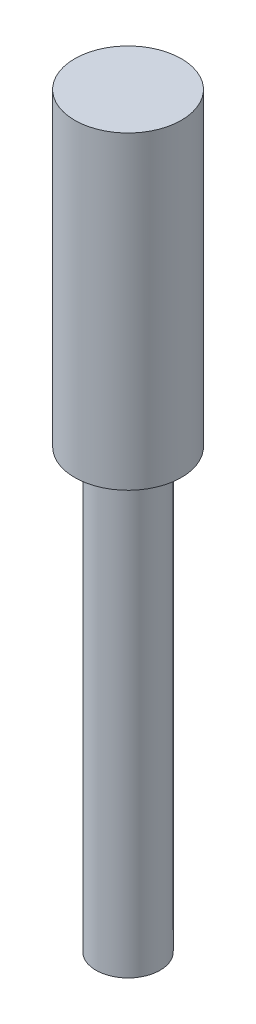
ISO-10303-21;
HEADER;
FILE_DESCRIPTION(('STEP AP214'),'2;1');
FILE_NAME('part.step','',(''),(''),'','','');
FILE_SCHEMA(('AUTOMOTIVE_DESIGN { 1 0 10303 214 1 1 1 1 }'));
ENDSEC;
DATA;
#1=APPLICATION_CONTEXT('core data for automotive mechanical design processes');
#2=APPLICATION_PROTOCOL_DEFINITION('international standard','automotive_design',2000,#1);
#3=PRODUCT_CONTEXT('',#1,'mechanical');
#4=PRODUCT('Part','Part','',(#3));
#5=PRODUCT_RELATED_PRODUCT_CATEGORY('part','',(#4));
#6=PRODUCT_DEFINITION_FORMATION('','',#4);
#7=PRODUCT_DEFINITION_CONTEXT('part definition',#1,'design');
#8=PRODUCT_DEFINITION('design','',#6,#7);
#9=PRODUCT_DEFINITION_SHAPE('','',#8);
#10=(LENGTH_UNIT() NAMED_UNIT(*) SI_UNIT(.MILLI.,.METRE.));
#11=(NAMED_UNIT(*) PLANE_ANGLE_UNIT() SI_UNIT($,.RADIAN.));
#12=(NAMED_UNIT(*) SI_UNIT($,.STERADIAN.) SOLID_ANGLE_UNIT());
#13=UNCERTAINTY_MEASURE_WITH_UNIT(LENGTH_MEASURE(1.E-05),#10,'distance_accuracy_value','');
#14=(GEOMETRIC_REPRESENTATION_CONTEXT(3) GLOBAL_UNCERTAINTY_ASSIGNED_CONTEXT((#13)) GLOBAL_UNIT_ASSIGNED_CONTEXT((#10,
#11,#12)) REPRESENTATION_CONTEXT('',''));
#15=CARTESIAN_POINT('',(0.,0.,0.));
#16=DIRECTION('',(0.,0.,1.));
#17=DIRECTION('',(1.,0.,0.));
#18=AXIS2_PLACEMENT_3D('',#15,#16,#17);
#19=CARTESIAN_POINT('',(0.,70.,0.));
#20=DIRECTION('',(0.,-1.,0.));
#21=DIRECTION('',(0.,0.,-1.));
#22=AXIS2_PLACEMENT_3D('',#19,#20,#21);
#23=CYLINDRICAL_SURFACE('',#22,5.);
#24=CARTESIAN_POINT('',(0.,70.,0.));
#25=DIRECTION('',(0.,1.,0.));
#26=DIRECTION('',(0.,0.,1.));
#27=AXIS2_PLACEMENT_3D('',#24,#25,#26);
#28=CIRCLE('',#27,5.);
#29=CARTESIAN_POINT('',(0.,70.,5.));
#30=VERTEX_POINT('',#29);
#31=EDGE_CURVE('E10',#30,#30,#28,.T.);
#32=ORIENTED_EDGE('',*,*,#31,.F.);
#33=EDGE_LOOP('',(#32));
#34=FACE_BOUND('',#33,.T.);
#35=CARTESIAN_POINT('',(0.,41.,0.));
#36=DIRECTION('',(0.,-1.,0.));
#37=DIRECTION('',(0.,0.,-1.));
#38=AXIS2_PLACEMENT_3D('',#35,#36,#37);
#39=CIRCLE('',#38,5.);
#40=CARTESIAN_POINT('',(0.,41.,-5.));
#41=VERTEX_POINT('',#40);
#42=EDGE_CURVE('E36',#41,#41,#39,.T.);
#43=ORIENTED_EDGE('',*,*,#42,.F.);
#44=EDGE_LOOP('',(#43));
#45=FACE_BOUND('',#44,.T.);
#46=ADVANCED_FACE('F30',(#34,#45),#23,.T.);
#47=CARTESIAN_POINT('',(0.,70.,0.));
#48=DIRECTION('',(0.,1.,0.));
#49=DIRECTION('',(0.,0.,1.));
#50=AXIS2_PLACEMENT_3D('',#47,#48,#49);
#51=PLANE('',#50);
#52=ORIENTED_EDGE('',*,*,#31,.T.);
#53=EDGE_LOOP('',(#52));
#54=FACE_BOUND('',#53,.T.);
#55=ADVANCED_FACE('F61',(#54),#51,.T.);
#56=CARTESIAN_POINT('',(0.,41.,0.));
#57=DIRECTION('',(0.,-1.,0.));
#58=DIRECTION('',(0.,0.,-1.));
#59=AXIS2_PLACEMENT_3D('',#56,#57,#58);
#60=PLANE('',#59);
#61=CARTESIAN_POINT('',(0.,41.,0.));
#62=DIRECTION('',(0.,-1.,0.));
#63=DIRECTION('',(0.,0.,-1.));
#64=AXIS2_PLACEMENT_3D('',#61,#62,#63);
#65=CIRCLE('',#64,3.);
#66=CARTESIAN_POINT('',(0.,41.,-3.));
#67=VERTEX_POINT('',#66);
#68=EDGE_CURVE('E40',#67,#67,#65,.T.);
#69=ORIENTED_EDGE('',*,*,#68,.F.);
#70=EDGE_LOOP('',(#69));
#71=FACE_BOUND('',#70,.T.);
#72=ORIENTED_EDGE('',*,*,#42,.T.);
#73=EDGE_LOOP('',(#72));
#74=FACE_BOUND('',#73,.T.);
#75=ADVANCED_FACE('F54',(#71,#74),#60,.T.);
#76=CARTESIAN_POINT('',(0.,41.,0.));
#77=DIRECTION('',(0.,-1.,0.));
#78=DIRECTION('',(0.,0.,-1.));
#79=AXIS2_PLACEMENT_3D('',#76,#77,#78);
#80=CYLINDRICAL_SURFACE('',#79,3.);
#81=ORIENTED_EDGE('',*,*,#68,.T.);
#82=EDGE_LOOP('',(#81));
#83=FACE_BOUND('',#82,.T.);
#84=CARTESIAN_POINT('',(0.,0.,0.));
#85=DIRECTION('',(0.,-1.,0.));
#86=DIRECTION('',(0.,0.,-1.));
#87=AXIS2_PLACEMENT_3D('',#84,#85,#86);
#88=CIRCLE('',#87,3.);
#89=CARTESIAN_POINT('',(0.,0.,-3.));
#90=VERTEX_POINT('',#89);
#91=EDGE_CURVE('E44',#90,#90,#88,.T.);
#92=ORIENTED_EDGE('',*,*,#91,.F.);
#93=EDGE_LOOP('',(#92));
#94=FACE_BOUND('',#93,.T.);
#95=ADVANCED_FACE('F52',(#83,#94),#80,.T.);
#96=CARTESIAN_POINT('',(0.,0.,0.));
#97=DIRECTION('',(0.,1.,0.));
#98=DIRECTION('',(0.,0.,1.));
#99=AXIS2_PLACEMENT_3D('',#96,#97,#98);
#100=PLANE('',#99);
#101=ORIENTED_EDGE('',*,*,#91,.T.);
#102=EDGE_LOOP('',(#101));
#103=FACE_BOUND('',#102,.T.);
#104=ADVANCED_FACE('F50',(#103),#100,.F.);
#105=CLOSED_SHELL('',(#46,#55,#75,#95,#104));
#106=MANIFOLD_SOLID_BREP('B2',#105);
#107=ADVANCED_BREP_SHAPE_REPRESENTATION('',(#18,#106),#14);
#108=SHAPE_DEFINITION_REPRESENTATION(#9,#107);
ENDSEC;
END-ISO-10303-21;
